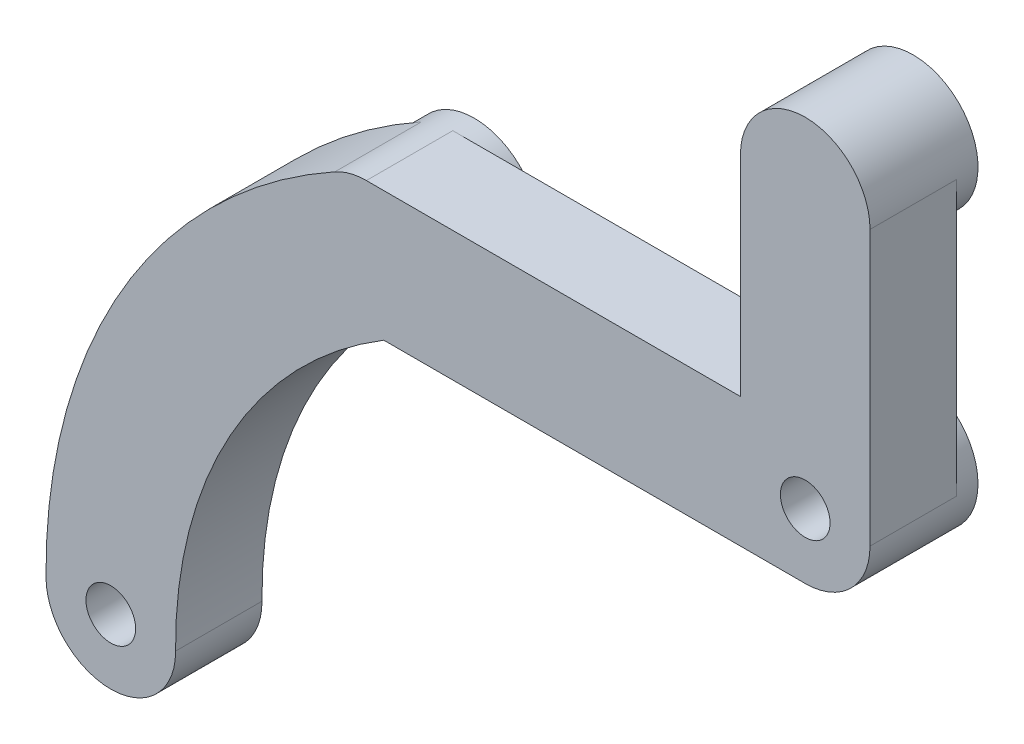
ISO-10303-21;
HEADER;
FILE_DESCRIPTION(('STEP AP214'),'2;1');
FILE_NAME('part.step','',(''),(''),'','','');
FILE_SCHEMA(('AUTOMOTIVE_DESIGN { 1 0 10303 214 1 1 1 1 }'));
ENDSEC;
DATA;
#1=APPLICATION_CONTEXT('core data for automotive mechanical design processes');
#2=APPLICATION_PROTOCOL_DEFINITION('international standard','automotive_design',2000,#1);
#3=PRODUCT_CONTEXT('',#1,'mechanical');
#4=PRODUCT('Part','Part','',(#3));
#5=PRODUCT_RELATED_PRODUCT_CATEGORY('part','',(#4));
#6=PRODUCT_DEFINITION_FORMATION('','',#4);
#7=PRODUCT_DEFINITION_CONTEXT('part definition',#1,'design');
#8=PRODUCT_DEFINITION('design','',#6,#7);
#9=PRODUCT_DEFINITION_SHAPE('','',#8);
#10=(LENGTH_UNIT() NAMED_UNIT(*) SI_UNIT(.MILLI.,.METRE.));
#11=(NAMED_UNIT(*) PLANE_ANGLE_UNIT() SI_UNIT($,.RADIAN.));
#12=(NAMED_UNIT(*) SI_UNIT($,.STERADIAN.) SOLID_ANGLE_UNIT());
#13=UNCERTAINTY_MEASURE_WITH_UNIT(LENGTH_MEASURE(1.E-05),#10,'distance_accuracy_value','');
#14=(GEOMETRIC_REPRESENTATION_CONTEXT(3) GLOBAL_UNCERTAINTY_ASSIGNED_CONTEXT((#13)) GLOBAL_UNIT_ASSIGNED_CONTEXT((#10,
#11,#12)) REPRESENTATION_CONTEXT('',''));
#15=CARTESIAN_POINT('',(0.,0.,0.));
#16=DIRECTION('',(0.,0.,1.));
#17=DIRECTION('',(1.,0.,0.));
#18=AXIS2_PLACEMENT_3D('',#15,#16,#17);
#19=CARTESIAN_POINT('',(-2.53999999999998,2.54000000000002,5.));
#20=DIRECTION('',(0.,0.,-1.));
#21=DIRECTION('',(-1.,0.,0.));
#22=AXIS2_PLACEMENT_3D('',#19,#20,#21);
#23=CYLINDRICAL_SURFACE('',#22,3.);
#24=CARTESIAN_POINT('',(-2.53999999999998,2.54000000000002,0.));
#25=DIRECTION('',(0.,0.,1.));
#26=DIRECTION('',(1.,0.,0.));
#27=AXIS2_PLACEMENT_3D('',#24,#25,#26);
#28=CIRCLE('',#27,3.);
#29=CARTESIAN_POINT('',(0.460000000000019,2.54000000000002,0.));
#30=VERTEX_POINT('',#29);
#31=EDGE_CURVE('E149',#30,#30,#28,.T.);
#32=ORIENTED_EDGE('',*,*,#31,.T.);
#33=EDGE_LOOP('',(#32));
#34=FACE_BOUND('',#33,.T.);
#35=CARTESIAN_POINT('',(-2.53999999999998,2.54000000000002,5.));
#36=DIRECTION('',(0.,0.,1.));
#37=DIRECTION('',(1.,0.,0.));
#38=AXIS2_PLACEMENT_3D('',#35,#36,#37);
#39=CIRCLE('',#38,3.);
#40=CARTESIAN_POINT('',(-2.53999999999998,-0.459999999999989,5.));
#41=VERTEX_POINT('',#40);
#42=CARTESIAN_POINT('',(0.460000000000041,2.54000000000002,5.));
#43=VERTEX_POINT('',#42);
#44=EDGE_CURVE('E116',#41,#43,#39,.T.);
#45=ORIENTED_EDGE('',*,*,#44,.F.);
#46=DIRECTION('',(0.,0.,1.));
#47=VECTOR('',#46,1.);
#48=CARTESIAN_POINT('',(-2.53999999999998,-0.459999999999983,-20.1873169608612));
#49=LINE('',#48,#47);
#50=CARTESIAN_POINT('',(-2.53999999999998,-0.459999999999983,1.00000000000001));
#51=VERTEX_POINT('',#50);
#52=EDGE_CURVE('E203',#51,#41,#49,.T.);
#53=ORIENTED_EDGE('',*,*,#52,.F.);
#54=CARTESIAN_POINT('',(-2.53999999999998,2.54000000000002,1.00000000000001));
#55=DIRECTION('',(0.,0.,-1.));
#56=DIRECTION('',(-1.,0.,0.));
#57=AXIS2_PLACEMENT_3D('',#54,#55,#56);
#58=CIRCLE('',#57,3.);
#59=CARTESIAN_POINT('',(0.460000000000041,2.54000000000002,1.00000000000001));
#60=VERTEX_POINT('',#59);
#61=EDGE_CURVE('E141',#51,#60,#58,.T.);
#62=ORIENTED_EDGE('',*,*,#61,.T.);
#63=DIRECTION('',(0.,0.,1.));
#64=VECTOR('',#63,1.);
#65=CARTESIAN_POINT('',(0.460000000000041,2.54000000000002,-14.0459958707099));
#66=LINE('',#65,#64);
#67=EDGE_CURVE('E135',#60,#43,#66,.T.);
#68=ORIENTED_EDGE('',*,*,#67,.T.);
#69=EDGE_LOOP('',(#45,#53,#62,#68));
#70=FACE_BOUND('',#69,.T.);
#71=ADVANCED_FACE('F38',(#34,#70),#23,.T.);
#72=CARTESIAN_POINT('',(-2.53999999999998,2.54000000000002,5.00000000000013));
#73=DIRECTION('',(0.,0.,-1.));
#74=DIRECTION('',(-1.,0.,0.));
#75=AXIS2_PLACEMENT_3D('',#72,#73,#74);
#76=CYLINDRICAL_SURFACE('',#75,1.15);
#77=CARTESIAN_POINT('',(-2.53999999999998,2.54000000000002,0.));
#78=DIRECTION('',(0.,0.,-1.));
#79=DIRECTION('',(-1.,0.,0.));
#80=AXIS2_PLACEMENT_3D('',#77,#78,#79);
#81=CIRCLE('',#80,1.15);
#82=CARTESIAN_POINT('',(-3.68999999999998,2.54000000000002,0.));
#83=VERTEX_POINT('',#82);
#84=EDGE_CURVE('E129',#83,#83,#81,.T.);
#85=ORIENTED_EDGE('',*,*,#84,.T.);
#86=EDGE_LOOP('',(#85));
#87=FACE_BOUND('',#86,.T.);
#88=CARTESIAN_POINT('',(-2.53999999999998,2.54000000000002,5.));
#89=DIRECTION('',(0.,0.,1.));
#90=DIRECTION('',(1.,0.,0.));
#91=AXIS2_PLACEMENT_3D('',#88,#89,#90);
#92=CIRCLE('',#91,1.15);
#93=CARTESIAN_POINT('',(-1.38999999999998,2.54000000000002,5.));
#94=VERTEX_POINT('',#93);
#95=EDGE_CURVE('E42',#94,#94,#92,.F.);
#96=ORIENTED_EDGE('',*,*,#95,.F.);
#97=EDGE_LOOP('',(#96));
#98=FACE_BOUND('',#97,.T.);
#99=ADVANCED_FACE('F252',(#87,#98),#76,.F.);
#100=CARTESIAN_POINT('',(-22.86,2.54000000000002,5.));
#101=DIRECTION('',(0.,0.,-1.));
#102=DIRECTION('',(-1.,0.,0.));
#103=AXIS2_PLACEMENT_3D('',#100,#101,#102);
#104=CYLINDRICAL_SURFACE('',#103,3.);
#105=DIRECTION('',(0.,0.,1.));
#106=VECTOR('',#105,1.);
#107=CARTESIAN_POINT('',(-22.86,5.54000000000001,-20.1873169608612));
#108=LINE('',#107,#106);
#109=CARTESIAN_POINT('',(-22.86,5.54000000000002,1.00000000000005));
#110=VERTEX_POINT('',#109);
#111=CARTESIAN_POINT('',(-22.86,5.54000000000002,5.));
#112=VERTEX_POINT('',#111);
#113=EDGE_CURVE('E217',#110,#112,#108,.T.);
#114=ORIENTED_EDGE('',*,*,#113,.F.);
#115=CARTESIAN_POINT('',(-22.86,2.54000000000002,1.00000000000008));
#116=DIRECTION('',(0.,0.,1.));
#117=DIRECTION('',(1.,0.,0.));
#118=AXIS2_PLACEMENT_3D('',#115,#116,#117);
#119=CIRCLE('',#118,3.);
#120=CARTESIAN_POINT('',(-24.3161661411759,5.16289537902159,1.00000000000009));
#121=VERTEX_POINT('',#120);
#122=EDGE_CURVE('E47',#121,#110,#119,.T.);
#123=ORIENTED_EDGE('',*,*,#122,.F.);
#124=DIRECTION('',(0.,0.,-1.));
#125=VECTOR('',#124,1.);
#126=CARTESIAN_POINT('',(-24.3161661411758,5.16289537902159,35.6297382465993));
#127=LINE('',#126,#125);
#128=CARTESIAN_POINT('',(-24.3161661411759,5.16289537902159,5.));
#129=VERTEX_POINT('',#128);
#130=EDGE_CURVE('E168',#129,#121,#127,.T.);
#131=ORIENTED_EDGE('',*,*,#130,.F.);
#132=CARTESIAN_POINT('',(-22.86,2.54000000000002,5.));
#133=DIRECTION('',(0.,0.,1.));
#134=DIRECTION('',(-1.,0.,0.));
#135=AXIS2_PLACEMENT_3D('',#132,#133,#134);
#136=CIRCLE('',#135,3.);
#137=EDGE_CURVE('E60',#112,#129,#136,.T.);
#138=ORIENTED_EDGE('',*,*,#137,.F.);
#139=EDGE_LOOP('',(#114,#123,#131,#138));
#140=FACE_BOUND('',#139,.T.);
#141=CARTESIAN_POINT('',(-22.86,2.54000000000002,0.));
#142=DIRECTION('',(0.,0.,1.));
#143=DIRECTION('',(-1.,0.,0.));
#144=AXIS2_PLACEMENT_3D('',#141,#142,#143);
#145=CIRCLE('',#144,3.);
#146=CARTESIAN_POINT('',(-25.86,2.54000000000002,0.));
#147=VERTEX_POINT('',#146);
#148=EDGE_CURVE('E180',#147,#147,#145,.T.);
#149=ORIENTED_EDGE('',*,*,#148,.T.);
#150=EDGE_LOOP('',(#149));
#151=FACE_BOUND('',#150,.T.);
#152=ADVANCED_FACE('F190',(#140,#151),#104,.T.);
#153=CARTESIAN_POINT('',(-22.86,2.54000000000002,5.));
#154=DIRECTION('',(0.,0.,-1.));
#155=DIRECTION('',(-1.,0.,0.));
#156=AXIS2_PLACEMENT_3D('',#153,#154,#155);
#157=PLANE('',#156);
#158=CARTESIAN_POINT('',(-34.695141036081,-17.7744183979436,5.00000000000012));
#159=DIRECTION('',(0.,0.,-1.));
#160=DIRECTION('',(-1.,0.,0.));
#161=AXIS2_PLACEMENT_3D('',#158,#159,#160);
#162=CIRCLE('',#161,1.15);
#163=CARTESIAN_POINT('',(-35.845141036081,-17.7744183979436,5.00000000000013));
#164=VERTEX_POINT('',#163);
#165=EDGE_CURVE('E291',#164,#164,#162,.T.);
#166=ORIENTED_EDGE('',*,*,#165,.T.);
#167=EDGE_LOOP('',(#166));
#168=FACE_BOUND('',#167,.T.);
#169=DIRECTION('',(1.,0.,0.));
#170=VECTOR('',#169,1.);
#171=CARTESIAN_POINT('',(-22.86,-0.459999999999981,5.));
#172=LINE('',#171,#170);
#173=CARTESIAN_POINT('',(-22.0539914744151,-0.459999999999985,5.));
#174=VERTEX_POINT('',#173);
#175=EDGE_CURVE('E124',#174,#41,#172,.T.);
#176=ORIENTED_EDGE('',*,*,#175,.T.);
#177=ORIENTED_EDGE('',*,*,#44,.T.);
#178=DIRECTION('',(0.,1.,0.));
#179=VECTOR('',#178,1.);
#180=CARTESIAN_POINT('',(0.460000000000038,15.24,5.));
#181=LINE('',#180,#179);
#182=CARTESIAN_POINT('',(0.460000000000038,15.24,5.));
#183=VERTEX_POINT('',#182);
#184=EDGE_CURVE('E120',#43,#183,#181,.T.);
#185=ORIENTED_EDGE('',*,*,#184,.T.);
#186=CARTESIAN_POINT('',(-2.53999999999998,15.24,5.));
#187=DIRECTION('',(0.,0.,1.));
#188=DIRECTION('',(-1.,0.,0.));
#189=AXIS2_PLACEMENT_3D('',#186,#187,#188);
#190=CIRCLE('',#189,3.);
#191=CARTESIAN_POINT('',(-5.53999999999996,15.24,5.));
#192=VERTEX_POINT('',#191);
#193=EDGE_CURVE('E219',#183,#192,#190,.T.);
#194=ORIENTED_EDGE('',*,*,#193,.T.);
#195=DIRECTION('',(0.,-1.,0.));
#196=VECTOR('',#195,1.);
#197=CARTESIAN_POINT('',(-5.53999999999996,15.24,5.));
#198=LINE('',#197,#196);
#199=CARTESIAN_POINT('',(-5.53999999999996,5.54000000000002,5.));
#200=VERTEX_POINT('',#199);
#201=EDGE_CURVE('E138',#192,#200,#198,.T.);
#202=ORIENTED_EDGE('',*,*,#201,.T.);
#203=DIRECTION('',(-1.,0.,0.));
#204=VECTOR('',#203,1.);
#205=CARTESIAN_POINT('',(-22.86,5.54000000000001,5.));
#206=LINE('',#205,#204);
#207=EDGE_CURVE('E188',#200,#112,#206,.T.);
#208=ORIENTED_EDGE('',*,*,#207,.T.);
#209=ORIENTED_EDGE('',*,*,#137,.T.);
#210=CARTESIAN_POINT('',(-11.6960595843177,-17.5688645724987,5.));
#211=DIRECTION('',(0.,0.,1.));
#212=DIRECTION('',(1.,0.,0.));
#213=AXIS2_PLACEMENT_3D('',#210,#211,#212);
#214=CIRCLE('',#213,26.);
#215=CARTESIAN_POINT('',(-37.6950212254415,-17.8012297664799,5.));
#216=VERTEX_POINT('',#215);
#217=EDGE_CURVE('E165',#216,#129,#214,.F.);
#218=ORIENTED_EDGE('',*,*,#217,.F.);
#219=CARTESIAN_POINT('',(-34.695141036081,-17.7744183979436,5.));
#220=DIRECTION('',(0.,0.,1.));
#221=DIRECTION('',(1.,0.,0.));
#222=AXIS2_PLACEMENT_3D('',#219,#220,#221);
#223=CIRCLE('',#222,3.);
#224=CARTESIAN_POINT('',(-31.6952608467206,-17.7476070294073,5.));
#225=VERTEX_POINT('',#224);
#226=EDGE_CURVE('E170',#225,#216,#223,.F.);
#227=ORIENTED_EDGE('',*,*,#226,.F.);
#228=CARTESIAN_POINT('',(-11.6960595843177,-17.5688645724987,5.));
#229=DIRECTION('',(0.,0.,1.));
#230=DIRECTION('',(1.,0.,0.));
#231=AXIS2_PLACEMENT_3D('',#228,#229,#230);
#232=CIRCLE('',#231,20.);
#233=EDGE_CURVE('E161',#174,#225,#232,.T.);
#234=ORIENTED_EDGE('',*,*,#233,.F.);
#235=EDGE_LOOP('',(#176,#177,#185,#194,#202,#208,#209,#218,#227,#234));
#236=FACE_BOUND('',#235,.T.);
#237=ORIENTED_EDGE('',*,*,#95,.T.);
#238=EDGE_LOOP('',(#237));
#239=FACE_BOUND('',#238,.T.);
#240=ADVANCED_FACE('F40',(#168,#236,#239),#157,.F.);
#241=CARTESIAN_POINT('',(-22.86,2.54000000000002,0.));
#242=DIRECTION('',(0.,0.,-1.));
#243=DIRECTION('',(-1.,0.,0.));
#244=AXIS2_PLACEMENT_3D('',#241,#242,#243);
#245=PLANE('',#244);
#246=CARTESIAN_POINT('',(-22.86,2.54000000000002,0.));
#247=DIRECTION('',(0.,0.,-1.));
#248=DIRECTION('',(1.,0.,0.));
#249=AXIS2_PLACEMENT_3D('',#246,#247,#248);
#250=CIRCLE('',#249,1.7);
#251=CARTESIAN_POINT('',(-21.16,2.54000000000002,0.));
#252=VERTEX_POINT('',#251);
#253=EDGE_CURVE('E283',#252,#252,#250,.T.);
#254=ORIENTED_EDGE('',*,*,#253,.F.);
#255=EDGE_LOOP('',(#254));
#256=FACE_BOUND('',#255,.T.);
#257=ORIENTED_EDGE('',*,*,#148,.F.);
#258=EDGE_LOOP('',(#257));
#259=FACE_BOUND('',#258,.T.);
#260=ADVANCED_FACE('F265',(#256,#259),#245,.T.);
#261=CARTESIAN_POINT('',(-11.6960595843177,-17.5688645724987,1.00000000000004));
#262=DIRECTION('',(0.,0.,1.));
#263=DIRECTION('',(1.,0.,0.));
#264=AXIS2_PLACEMENT_3D('',#261,#262,#263);
#265=PLANE('',#264);
#266=CARTESIAN_POINT('',(-34.695141036081,-17.7744183979436,1.00000000000012));
#267=DIRECTION('',(0.,0.,-1.));
#268=DIRECTION('',(-1.,0.,0.));
#269=AXIS2_PLACEMENT_3D('',#266,#267,#268);
#270=CIRCLE('',#269,1.15);
#271=CARTESIAN_POINT('',(-35.845141036081,-17.7744183979436,1.00000000000013));
#272=VERTEX_POINT('',#271);
#273=EDGE_CURVE('E293',#272,#272,#270,.T.);
#274=ORIENTED_EDGE('',*,*,#273,.F.);
#275=EDGE_LOOP('',(#274));
#276=FACE_BOUND('',#275,.T.);
#277=CARTESIAN_POINT('',(-11.6960595843177,-17.5688645724987,1.00000000000004));
#278=DIRECTION('',(0.,0.,1.));
#279=DIRECTION('',(1.,0.,0.));
#280=AXIS2_PLACEMENT_3D('',#277,#278,#279);
#281=CIRCLE('',#280,20.);
#282=CARTESIAN_POINT('',(-22.0539914744151,-0.459999999999981,1.00000000000008));
#283=VERTEX_POINT('',#282);
#284=CARTESIAN_POINT('',(-31.6952608467206,-17.7476070294073,1.00000000000011));
#285=VERTEX_POINT('',#284);
#286=EDGE_CURVE('E162',#283,#285,#281,.T.);
#287=ORIENTED_EDGE('',*,*,#286,.T.);
#288=CARTESIAN_POINT('',(-34.695141036081,-17.7744183979436,1.00000000000012));
#289=DIRECTION('',(0.,0.,-1.));
#290=DIRECTION('',(1.,0.,0.));
#291=AXIS2_PLACEMENT_3D('',#288,#289,#290);
#292=CIRCLE('',#291,3.);
#293=CARTESIAN_POINT('',(-37.6950212254415,-17.8012297664799,1.00000000000013));
#294=VERTEX_POINT('',#293);
#295=EDGE_CURVE('E158',#285,#294,#292,.T.);
#296=ORIENTED_EDGE('',*,*,#295,.T.);
#297=CARTESIAN_POINT('',(-11.6960595843177,-17.5688645724987,1.00000000000004));
#298=DIRECTION('',(0.,0.,-1.));
#299=DIRECTION('',(1.,0.,0.));
#300=AXIS2_PLACEMENT_3D('',#297,#298,#299);
#301=CIRCLE('',#300,26.);
#302=EDGE_CURVE('E157',#294,#121,#301,.T.);
#303=ORIENTED_EDGE('',*,*,#302,.T.);
#304=ORIENTED_EDGE('',*,*,#122,.T.);
#305=DIRECTION('',(-1.,0.,0.));
#306=VECTOR('',#305,1.);
#307=CARTESIAN_POINT('',(-22.8599999999999,5.54000000000001,1.00000000000008));
#308=LINE('',#307,#306);
#309=CARTESIAN_POINT('',(-5.53999999999996,5.54000000000002,1.00000000000002));
#310=VERTEX_POINT('',#309);
#311=EDGE_CURVE('E214',#310,#110,#308,.T.);
#312=ORIENTED_EDGE('',*,*,#311,.F.);
#313=DIRECTION('',(0.,-1.,0.));
#314=VECTOR('',#313,1.);
#315=CARTESIAN_POINT('',(-5.53999999999996,15.24,1.00000000000002));
#316=LINE('',#315,#314);
#317=CARTESIAN_POINT('',(-5.53999999999996,15.24,1.00000000000002));
#318=VERTEX_POINT('',#317);
#319=EDGE_CURVE('E152',#318,#310,#316,.T.);
#320=ORIENTED_EDGE('',*,*,#319,.F.);
#321=CARTESIAN_POINT('',(-2.53999999999998,15.24,1.00000000000001));
#322=DIRECTION('',(0.,0.,-1.));
#323=DIRECTION('',(-1.,0.,0.));
#324=AXIS2_PLACEMENT_3D('',#321,#322,#323);
#325=CIRCLE('',#324,3.);
#326=CARTESIAN_POINT('',(0.460000000000038,15.24,0.999999999999999));
#327=VERTEX_POINT('',#326);
#328=EDGE_CURVE('E224',#318,#327,#325,.F.);
#329=ORIENTED_EDGE('',*,*,#328,.T.);
#330=DIRECTION('',(0.,1.,0.));
#331=VECTOR('',#330,1.);
#332=CARTESIAN_POINT('',(0.460000000000038,15.24,0.999999999999999));
#333=LINE('',#332,#331);
#334=EDGE_CURVE('E143',#60,#327,#333,.T.);
#335=ORIENTED_EDGE('',*,*,#334,.F.);
#336=ORIENTED_EDGE('',*,*,#61,.F.);
#337=DIRECTION('',(1.,0.,0.));
#338=VECTOR('',#337,1.);
#339=CARTESIAN_POINT('',(-22.8599999999999,-0.459999999999981,1.00000000000008));
#340=LINE('',#339,#338);
#341=EDGE_CURVE('E206',#283,#51,#340,.T.);
#342=ORIENTED_EDGE('',*,*,#341,.F.);
#343=EDGE_LOOP('',(#287,#296,#303,#304,#312,#320,#329,#335,#336,#342));
#344=FACE_BOUND('',#343,.T.);
#345=ADVANCED_FACE('F238',(#276,#344),#265,.F.);
#346=CARTESIAN_POINT('',(-11.6960595843176,-17.5688645724987,35.6297382465992));
#347=DIRECTION('',(0.,0.,-1.));
#348=DIRECTION('',(-1.,0.,0.));
#349=AXIS2_PLACEMENT_3D('',#346,#347,#348);
#350=CYLINDRICAL_SURFACE('',#349,20.);
#351=DIRECTION('',(0.,0.,-1.));
#352=VECTOR('',#351,1.);
#353=CARTESIAN_POINT('',(-22.053991474415,-0.45999999999998,35.6297382465993));
#354=LINE('',#353,#352);
#355=EDGE_CURVE('E12',#174,#283,#354,.T.);
#356=ORIENTED_EDGE('',*,*,#355,.F.);
#357=ORIENTED_EDGE('',*,*,#233,.T.);
#358=DIRECTION('',(0.,0.,-1.));
#359=VECTOR('',#358,1.);
#360=CARTESIAN_POINT('',(-31.6952608467205,-17.7476070294073,35.6297382465993));
#361=LINE('',#360,#359);
#362=EDGE_CURVE('E173',#225,#285,#361,.T.);
#363=ORIENTED_EDGE('',*,*,#362,.T.);
#364=ORIENTED_EDGE('',*,*,#286,.F.);
#365=EDGE_LOOP('',(#356,#357,#363,#364));
#366=FACE_BOUND('',#365,.T.);
#367=ADVANCED_FACE('F264',(#366),#350,.F.);
#368=CARTESIAN_POINT('',(-34.6951410360809,-17.7744183979436,35.6297382465993));
#369=DIRECTION('',(0.,0.,-1.));
#370=DIRECTION('',(-1.,0.,0.));
#371=AXIS2_PLACEMENT_3D('',#368,#369,#370);
#372=CYLINDRICAL_SURFACE('',#371,3.);
#373=ORIENTED_EDGE('',*,*,#362,.F.);
#374=ORIENTED_EDGE('',*,*,#226,.T.);
#375=DIRECTION('',(0.,0.,-1.));
#376=VECTOR('',#375,1.);
#377=CARTESIAN_POINT('',(-37.6950212254414,-17.8012297664799,35.6297382465993));
#378=LINE('',#377,#376);
#379=EDGE_CURVE('E169',#216,#294,#378,.T.);
#380=ORIENTED_EDGE('',*,*,#379,.T.);
#381=ORIENTED_EDGE('',*,*,#295,.F.);
#382=EDGE_LOOP('',(#373,#374,#380,#381));
#383=FACE_BOUND('',#382,.T.);
#384=ADVANCED_FACE('F198',(#383),#372,.T.);
#385=CARTESIAN_POINT('',(-11.6960595843176,-17.5688645724987,35.6297382465992));
#386=DIRECTION('',(0.,0.,-1.));
#387=DIRECTION('',(-1.,0.,0.));
#388=AXIS2_PLACEMENT_3D('',#385,#386,#387);
#389=CYLINDRICAL_SURFACE('',#388,26.);
#390=ORIENTED_EDGE('',*,*,#379,.F.);
#391=ORIENTED_EDGE('',*,*,#217,.T.);
#392=ORIENTED_EDGE('',*,*,#130,.T.);
#393=ORIENTED_EDGE('',*,*,#302,.F.);
#394=EDGE_LOOP('',(#390,#391,#392,#393));
#395=FACE_BOUND('',#394,.T.);
#396=ADVANCED_FACE('F194',(#395),#389,.T.);
#397=CARTESIAN_POINT('',(-2.53999999999998,2.54000000000002,0.));
#398=DIRECTION('',(0.,0.,1.));
#399=DIRECTION('',(1.,0.,0.));
#400=AXIS2_PLACEMENT_3D('',#397,#398,#399);
#401=PLANE('',#400);
#402=ORIENTED_EDGE('',*,*,#84,.F.);
#403=EDGE_LOOP('',(#402));
#404=FACE_BOUND('',#403,.T.);
#405=ORIENTED_EDGE('',*,*,#31,.F.);
#406=EDGE_LOOP('',(#405));
#407=FACE_BOUND('',#406,.T.);
#408=ADVANCED_FACE('F248',(#404,#407),#401,.F.);
#409=CARTESIAN_POINT('',(0.460000000000038,15.24,-14.0459958707099));
#410=DIRECTION('',(1.,0.,0.));
#411=DIRECTION('',(0.,1.,0.));
#412=AXIS2_PLACEMENT_3D('',#409,#410,#411);
#413=PLANE('',#412);
#414=ORIENTED_EDGE('',*,*,#67,.F.);
#415=ORIENTED_EDGE('',*,*,#334,.T.);
#416=DIRECTION('',(0.,0.,1.));
#417=VECTOR('',#416,1.);
#418=CARTESIAN_POINT('',(0.460000000000038,15.24,-14.0459958707099));
#419=LINE('',#418,#417);
#420=EDGE_CURVE('E137',#327,#183,#419,.T.);
#421=ORIENTED_EDGE('',*,*,#420,.T.);
#422=ORIENTED_EDGE('',*,*,#184,.F.);
#423=EDGE_LOOP('',(#414,#415,#421,#422));
#424=FACE_BOUND('',#423,.T.);
#425=ADVANCED_FACE('F133',(#424),#413,.T.);
#426=CARTESIAN_POINT('',(-5.53999999999996,15.24,-14.0459958707099));
#427=DIRECTION('',(-1.,0.,0.));
#428=DIRECTION('',(0.,-1.,0.));
#429=AXIS2_PLACEMENT_3D('',#426,#427,#428);
#430=PLANE('',#429);
#431=DIRECTION('',(0.,0.,-1.));
#432=VECTOR('',#431,1.);
#433=CARTESIAN_POINT('',(-5.53999999999996,5.54000000000002,-14.0459958707099));
#434=LINE('',#433,#432);
#435=EDGE_CURVE('E154',#200,#310,#434,.T.);
#436=ORIENTED_EDGE('',*,*,#435,.F.);
#437=ORIENTED_EDGE('',*,*,#201,.F.);
#438=DIRECTION('',(0.,0.,1.));
#439=VECTOR('',#438,1.);
#440=CARTESIAN_POINT('',(-5.53999999999996,15.24,-14.0459958707099));
#441=LINE('',#440,#439);
#442=EDGE_CURVE('E228',#318,#192,#441,.T.);
#443=ORIENTED_EDGE('',*,*,#442,.F.);
#444=ORIENTED_EDGE('',*,*,#319,.T.);
#445=EDGE_LOOP('',(#436,#437,#443,#444));
#446=FACE_BOUND('',#445,.T.);
#447=ADVANCED_FACE('F239',(#446),#430,.T.);
#448=CARTESIAN_POINT('',(-2.53999999999998,15.24,5.));
#449=DIRECTION('',(0.,0.,-1.));
#450=DIRECTION('',(-1.,0.,0.));
#451=AXIS2_PLACEMENT_3D('',#448,#449,#450);
#452=CYLINDRICAL_SURFACE('',#451,3.);
#453=ORIENTED_EDGE('',*,*,#420,.F.);
#454=ORIENTED_EDGE('',*,*,#328,.F.);
#455=ORIENTED_EDGE('',*,*,#442,.T.);
#456=ORIENTED_EDGE('',*,*,#193,.F.);
#457=EDGE_LOOP('',(#453,#454,#455,#456));
#458=FACE_BOUND('',#457,.T.);
#459=CARTESIAN_POINT('',(-2.53999999999998,15.24,0.));
#460=DIRECTION('',(0.,0.,1.));
#461=DIRECTION('',(-1.,0.,0.));
#462=AXIS2_PLACEMENT_3D('',#459,#460,#461);
#463=CIRCLE('',#462,3.);
#464=CARTESIAN_POINT('',(-5.53999999999998,15.24,0.));
#465=VERTEX_POINT('',#464);
#466=EDGE_CURVE('E221',#465,#465,#463,.T.);
#467=ORIENTED_EDGE('',*,*,#466,.T.);
#468=EDGE_LOOP('',(#467));
#469=FACE_BOUND('',#468,.T.);
#470=ADVANCED_FACE('F233',(#458,#469),#452,.T.);
#471=CARTESIAN_POINT('',(-2.53999999999998,15.24,0.));
#472=DIRECTION('',(0.,0.,-1.));
#473=DIRECTION('',(-1.,0.,0.));
#474=AXIS2_PLACEMENT_3D('',#471,#472,#473);
#475=PLANE('',#474);
#476=CARTESIAN_POINT('',(-2.53999999999998,15.24,0.));
#477=DIRECTION('',(0.,0.,-1.));
#478=DIRECTION('',(-1.,0.,0.));
#479=AXIS2_PLACEMENT_3D('',#476,#477,#478);
#480=CIRCLE('',#479,1.7);
#481=CARTESIAN_POINT('',(-4.23999999999998,15.24,0.));
#482=VERTEX_POINT('',#481);
#483=EDGE_CURVE('E209',#482,#482,#480,.T.);
#484=ORIENTED_EDGE('',*,*,#483,.F.);
#485=EDGE_LOOP('',(#484));
#486=FACE_BOUND('',#485,.T.);
#487=ORIENTED_EDGE('',*,*,#466,.F.);
#488=EDGE_LOOP('',(#487));
#489=FACE_BOUND('',#488,.T.);
#490=ADVANCED_FACE('F246',(#486,#489),#475,.T.);
#491=CARTESIAN_POINT('',(-22.86,-0.459999999999981,-20.1873169608612));
#492=DIRECTION('',(0.,-1.,0.));
#493=DIRECTION('',(1.,0.,0.));
#494=AXIS2_PLACEMENT_3D('',#491,#492,#493);
#495=PLANE('',#494);
#496=ORIENTED_EDGE('',*,*,#175,.F.);
#497=ORIENTED_EDGE('',*,*,#355,.T.);
#498=ORIENTED_EDGE('',*,*,#341,.T.);
#499=ORIENTED_EDGE('',*,*,#52,.T.);
#500=EDGE_LOOP('',(#496,#497,#498,#499));
#501=FACE_BOUND('',#500,.T.);
#502=ADVANCED_FACE('F201',(#501),#495,.T.);
#503=CARTESIAN_POINT('',(-22.86,5.54000000000001,-20.1873169608612));
#504=DIRECTION('',(0.,1.,0.));
#505=DIRECTION('',(-1.,0.,0.));
#506=AXIS2_PLACEMENT_3D('',#503,#504,#505);
#507=PLANE('',#506);
#508=ORIENTED_EDGE('',*,*,#207,.F.);
#509=ORIENTED_EDGE('',*,*,#435,.T.);
#510=ORIENTED_EDGE('',*,*,#311,.T.);
#511=ORIENTED_EDGE('',*,*,#113,.T.);
#512=EDGE_LOOP('',(#508,#509,#510,#511));
#513=FACE_BOUND('',#512,.T.);
#514=ADVANCED_FACE('F237',(#513),#507,.T.);
#515=CARTESIAN_POINT('',(-2.53999999999998,15.24,4.));
#516=DIRECTION('',(0.,0.,-1.));
#517=DIRECTION('',(-1.,0.,0.));
#518=AXIS2_PLACEMENT_3D('',#515,#516,#517);
#519=CYLINDRICAL_SURFACE('',#518,1.7);
#520=CARTESIAN_POINT('',(-2.53999999999998,15.24,4.));
#521=DIRECTION('',(0.,0.,-1.));
#522=DIRECTION('',(-1.,0.,0.));
#523=AXIS2_PLACEMENT_3D('',#520,#521,#522);
#524=CIRCLE('',#523,1.7);
#525=CARTESIAN_POINT('',(-4.23999999999998,15.24,4.));
#526=VERTEX_POINT('',#525);
#527=EDGE_CURVE('E204',#526,#526,#524,.T.);
#528=ORIENTED_EDGE('',*,*,#527,.F.);
#529=EDGE_LOOP('',(#528));
#530=FACE_BOUND('',#529,.T.);
#531=ORIENTED_EDGE('',*,*,#483,.T.);
#532=EDGE_LOOP('',(#531));
#533=FACE_BOUND('',#532,.T.);
#534=ADVANCED_FACE('F340',(#530,#533),#519,.F.);
#535=CARTESIAN_POINT('',(-2.53999999999998,15.24,4.));
#536=DIRECTION('',(0.,0.,-1.));
#537=DIRECTION('',(-1.,0.,0.));
#538=AXIS2_PLACEMENT_3D('',#535,#536,#537);
#539=PLANE('',#538);
#540=ORIENTED_EDGE('',*,*,#527,.T.);
#541=EDGE_LOOP('',(#540));
#542=FACE_BOUND('',#541,.T.);
#543=ADVANCED_FACE('F347',(#542),#539,.T.);
#544=CARTESIAN_POINT('',(-22.86,2.54000000000002,4.));
#545=DIRECTION('',(0.,0.,-1.));
#546=DIRECTION('',(-1.,0.,0.));
#547=AXIS2_PLACEMENT_3D('',#544,#545,#546);
#548=CYLINDRICAL_SURFACE('',#547,1.7);
#549=CARTESIAN_POINT('',(-22.86,2.54000000000002,4.));
#550=DIRECTION('',(0.,0.,-1.));
#551=DIRECTION('',(1.,0.,0.));
#552=AXIS2_PLACEMENT_3D('',#549,#550,#551);
#553=CIRCLE('',#552,1.7);
#554=CARTESIAN_POINT('',(-21.16,2.54000000000002,4.));
#555=VERTEX_POINT('',#554);
#556=EDGE_CURVE('E286',#555,#555,#553,.T.);
#557=ORIENTED_EDGE('',*,*,#556,.F.);
#558=EDGE_LOOP('',(#557));
#559=FACE_BOUND('',#558,.T.);
#560=ORIENTED_EDGE('',*,*,#253,.T.);
#561=EDGE_LOOP('',(#560));
#562=FACE_BOUND('',#561,.T.);
#563=ADVANCED_FACE('F355',(#559,#562),#548,.F.);
#564=CARTESIAN_POINT('',(-22.86,2.54000000000002,4.));
#565=DIRECTION('',(0.,0.,1.));
#566=DIRECTION('',(1.,0.,0.));
#567=AXIS2_PLACEMENT_3D('',#564,#565,#566);
#568=PLANE('',#567);
#569=ORIENTED_EDGE('',*,*,#556,.T.);
#570=EDGE_LOOP('',(#569));
#571=FACE_BOUND('',#570,.T.);
#572=ADVANCED_FACE('F363',(#571),#568,.F.);
#573=CARTESIAN_POINT('',(-34.695141036081,-17.7744183979436,5.00000000000012));
#574=DIRECTION('',(0.,0.,-1.));
#575=DIRECTION('',(-1.,0.,0.));
#576=AXIS2_PLACEMENT_3D('',#573,#574,#575);
#577=CYLINDRICAL_SURFACE('',#576,1.15);
#578=ORIENTED_EDGE('',*,*,#165,.F.);
#579=EDGE_LOOP('',(#578));
#580=FACE_BOUND('',#579,.T.);
#581=ORIENTED_EDGE('',*,*,#273,.T.);
#582=EDGE_LOOP('',(#581));
#583=FACE_BOUND('',#582,.T.);
#584=ADVANCED_FACE('F371',(#580,#583),#577,.F.);
#585=CLOSED_SHELL('',(#71,#99,#152,#240,#260,#345,#367,#384,#396,#408,#425,#447,#470,#490,#502,
#514,#534,#543,#563,#572,#584));
#586=MANIFOLD_SOLID_BREP('B2',#585);
#587=ADVANCED_BREP_SHAPE_REPRESENTATION('',(#18,#586),#14);
#588=SHAPE_DEFINITION_REPRESENTATION(#9,#587);
ENDSEC;
END-ISO-10303-21;
